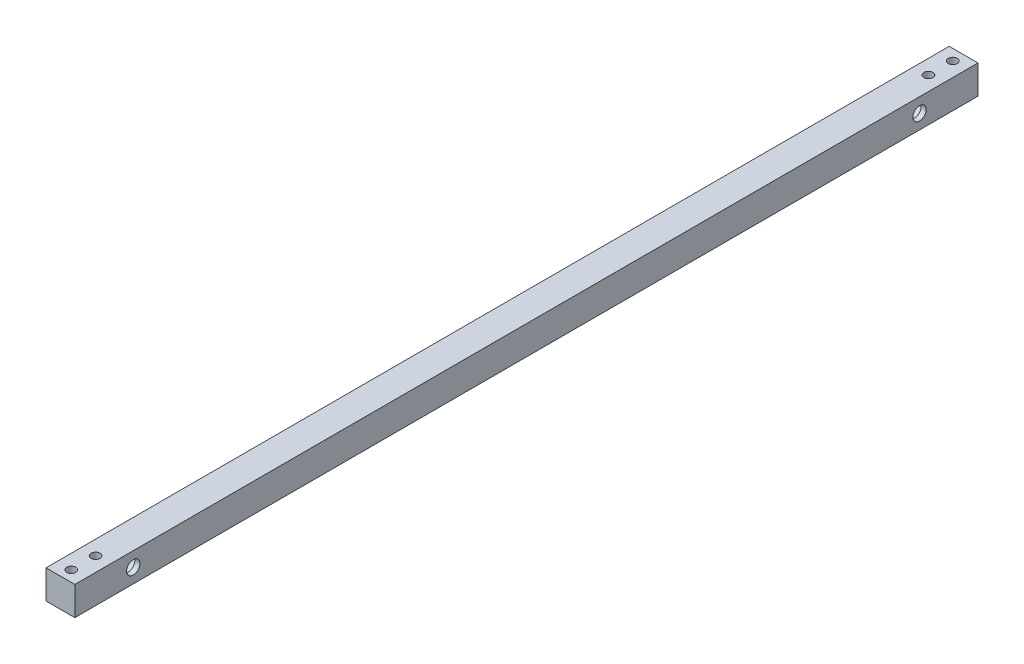
ISO-10303-21;
HEADER;
FILE_DESCRIPTION(('STEP AP214'),'2;1');
FILE_NAME('part.step','',(''),(''),'','','');
FILE_SCHEMA(('AUTOMOTIVE_DESIGN { 1 0 10303 214 1 1 1 1 }'));
ENDSEC;
DATA;
#1=APPLICATION_CONTEXT('core data for automotive mechanical design processes');
#2=APPLICATION_PROTOCOL_DEFINITION('international standard','automotive_design',2000,#1);
#3=PRODUCT_CONTEXT('',#1,'mechanical');
#4=PRODUCT('Part','Part','',(#3));
#5=PRODUCT_RELATED_PRODUCT_CATEGORY('part','',(#4));
#6=PRODUCT_DEFINITION_FORMATION('','',#4);
#7=PRODUCT_DEFINITION_CONTEXT('part definition',#1,'design');
#8=PRODUCT_DEFINITION('design','',#6,#7);
#9=PRODUCT_DEFINITION_SHAPE('','',#8);
#10=(LENGTH_UNIT() NAMED_UNIT(*) SI_UNIT(.MILLI.,.METRE.));
#11=(NAMED_UNIT(*) PLANE_ANGLE_UNIT() SI_UNIT($,.RADIAN.));
#12=(NAMED_UNIT(*) SI_UNIT($,.STERADIAN.) SOLID_ANGLE_UNIT());
#13=UNCERTAINTY_MEASURE_WITH_UNIT(LENGTH_MEASURE(1.E-05),#10,'distance_accuracy_value','');
#14=(GEOMETRIC_REPRESENTATION_CONTEXT(3) GLOBAL_UNCERTAINTY_ASSIGNED_CONTEXT((#13)) GLOBAL_UNIT_ASSIGNED_CONTEXT((#10,
#11,#12)) REPRESENTATION_CONTEXT('',''));
#15=CARTESIAN_POINT('',(0.,0.,0.));
#16=DIRECTION('',(0.,0.,1.));
#17=DIRECTION('',(1.,0.,0.));
#18=AXIS2_PLACEMENT_3D('',#15,#16,#17);
#19=CARTESIAN_POINT('',(0.,0.,497.84));
#20=DIRECTION('',(1.,0.,0.));
#21=DIRECTION('',(0.,1.,0.));
#22=AXIS2_PLACEMENT_3D('',#19,#20,#21);
#23=PLANE('',#22);
#24=CARTESIAN_POINT('',(0.,7.93749999999994,32.2199));
#25=DIRECTION('',(-1.,0.,0.));
#26=DIRECTION('',(0.,1.,0.));
#27=AXIS2_PLACEMENT_3D('',#24,#25,#26);
#28=CIRCLE('',#27,6.81989999999997);
#29=CARTESIAN_POINT('',(0.,14.7573999999999,32.2199));
#30=VERTEX_POINT('',#29);
#31=EDGE_CURVE('E159',#30,#30,#28,.T.);
#32=ORIENTED_EDGE('',*,*,#31,.F.);
#33=EDGE_LOOP('',(#32));
#34=FACE_BOUND('',#33,.T.);
#35=CARTESIAN_POINT('',(0.,7.9375,465.6201));
#36=DIRECTION('',(-1.,0.,0.));
#37=DIRECTION('',(0.,-1.,0.));
#38=AXIS2_PLACEMENT_3D('',#35,#36,#37);
#39=CIRCLE('',#38,6.81989999999997);
#40=CARTESIAN_POINT('',(0.,1.11760000000003,465.6201));
#41=VERTEX_POINT('',#40);
#42=EDGE_CURVE('E163',#41,#41,#39,.T.);
#43=ORIENTED_EDGE('',*,*,#42,.F.);
#44=EDGE_LOOP('',(#43));
#45=FACE_BOUND('',#44,.T.);
#46=DIRECTION('',(0.,-1.,0.));
#47=VECTOR('',#46,1.);
#48=CARTESIAN_POINT('',(0.,0.,0.));
#49=LINE('',#48,#47);
#50=CARTESIAN_POINT('',(0.,15.875,0.));
#51=VERTEX_POINT('',#50);
#52=CARTESIAN_POINT('',(0.,0.,0.));
#53=VERTEX_POINT('',#52);
#54=EDGE_CURVE('E100',#51,#53,#49,.T.);
#55=ORIENTED_EDGE('',*,*,#54,.T.);
#56=DIRECTION('',(0.,0.,-1.));
#57=VECTOR('',#56,1.);
#58=CARTESIAN_POINT('',(0.,0.,497.84));
#59=LINE('',#58,#57);
#60=CARTESIAN_POINT('',(0.,0.,497.84));
#61=VERTEX_POINT('',#60);
#62=EDGE_CURVE('E11',#61,#53,#59,.T.);
#63=ORIENTED_EDGE('',*,*,#62,.F.);
#64=DIRECTION('',(0.,-1.,0.));
#65=VECTOR('',#64,1.);
#66=CARTESIAN_POINT('',(0.,0.,497.84));
#67=LINE('',#66,#65);
#68=CARTESIAN_POINT('',(0.,15.875,497.84));
#69=VERTEX_POINT('',#68);
#70=EDGE_CURVE('E87',#69,#61,#67,.T.);
#71=ORIENTED_EDGE('',*,*,#70,.F.);
#72=DIRECTION('',(0.,0.,-1.));
#73=VECTOR('',#72,1.);
#74=CARTESIAN_POINT('',(0.,15.875,497.84));
#75=LINE('',#74,#73);
#76=EDGE_CURVE('E96',#69,#51,#75,.T.);
#77=ORIENTED_EDGE('',*,*,#76,.T.);
#78=EDGE_LOOP('',(#55,#63,#71,#77));
#79=FACE_BOUND('',#78,.T.);
#80=ADVANCED_FACE('F34',(#34,#45,#79),#23,.F.);
#81=CARTESIAN_POINT('',(0.,0.,497.84));
#82=DIRECTION('',(0.,1.,0.));
#83=DIRECTION('',(0.,0.,1.));
#84=AXIS2_PLACEMENT_3D('',#81,#82,#83);
#85=PLANE('',#84);
#86=CARTESIAN_POINT('',(7.93749999999993,1.99819154278469E-12,6.00000000000001));
#87=DIRECTION('',(0.,-1.,0.));
#88=DIRECTION('',(0.,0.,-1.));
#89=AXIS2_PLACEMENT_3D('',#86,#87,#88);
#90=CIRCLE('',#89,4.7625);
#91=CARTESIAN_POINT('',(7.93749999999993,1.99819154278469E-12,1.23750000000001));
#92=VERTEX_POINT('',#91);
#93=EDGE_CURVE('E203',#92,#92,#90,.T.);
#94=ORIENTED_EDGE('',*,*,#93,.F.);
#95=EDGE_LOOP('',(#94));
#96=FACE_BOUND('',#95,.T.);
#97=CARTESIAN_POINT('',(7.93749999999993,2.00116694049068E-12,19.4000000000001));
#98=DIRECTION('',(0.,-1.,0.));
#99=DIRECTION('',(0.,0.,-1.));
#100=AXIS2_PLACEMENT_3D('',#97,#98,#99);
#101=CIRCLE('',#100,4.7625);
#102=CARTESIAN_POINT('',(7.93749999999993,2.00116694049068E-12,14.6375000000001));
#103=VERTEX_POINT('',#102);
#104=EDGE_CURVE('E137',#103,#103,#101,.T.);
#105=ORIENTED_EDGE('',*,*,#104,.F.);
#106=EDGE_LOOP('',(#105));
#107=FACE_BOUND('',#106,.T.);
#108=CARTESIAN_POINT('',(7.9374999999996,2.3251389008605E-12,478.44));
#109=DIRECTION('',(0.,-1.,0.));
#110=DIRECTION('',(0.,0.,-1.));
#111=AXIS2_PLACEMENT_3D('',#108,#109,#110);
#112=CIRCLE('',#111,4.7625);
#113=CARTESIAN_POINT('',(7.9374999999996,2.3251389008605E-12,473.6775));
#114=VERTEX_POINT('',#113);
#115=EDGE_CURVE('E124',#114,#114,#112,.T.);
#116=ORIENTED_EDGE('',*,*,#115,.F.);
#117=EDGE_LOOP('',(#116));
#118=FACE_BOUND('',#117,.T.);
#119=CARTESIAN_POINT('',(7.9374999999996,2.3281142985665E-12,491.84));
#120=DIRECTION('',(0.,-1.,0.));
#121=DIRECTION('',(0.,0.,-1.));
#122=AXIS2_PLACEMENT_3D('',#119,#120,#121);
#123=CIRCLE('',#122,4.7625);
#124=CARTESIAN_POINT('',(7.9374999999996,2.3281142985665E-12,487.0775));
#125=VERTEX_POINT('',#124);
#126=EDGE_CURVE('E120',#125,#125,#123,.T.);
#127=ORIENTED_EDGE('',*,*,#126,.F.);
#128=EDGE_LOOP('',(#127));
#129=FACE_BOUND('',#128,.T.);
#130=DIRECTION('',(1.,0.,0.));
#131=VECTOR('',#130,1.);
#132=CARTESIAN_POINT('',(0.,0.,0.));
#133=LINE('',#132,#131);
#134=CARTESIAN_POINT('',(15.875,0.,0.));
#135=VERTEX_POINT('',#134);
#136=EDGE_CURVE('E91',#53,#135,#133,.T.);
#137=ORIENTED_EDGE('',*,*,#136,.T.);
#138=DIRECTION('',(0.,0.,-1.));
#139=VECTOR('',#138,1.);
#140=CARTESIAN_POINT('',(15.875,0.,497.84));
#141=LINE('',#140,#139);
#142=CARTESIAN_POINT('',(15.875,0.,497.84));
#143=VERTEX_POINT('',#142);
#144=EDGE_CURVE('E43',#143,#135,#141,.T.);
#145=ORIENTED_EDGE('',*,*,#144,.F.);
#146=DIRECTION('',(1.,0.,0.));
#147=VECTOR('',#146,1.);
#148=CARTESIAN_POINT('',(0.,0.,497.84));
#149=LINE('',#148,#147);
#150=EDGE_CURVE('E82',#61,#143,#149,.T.);
#151=ORIENTED_EDGE('',*,*,#150,.F.);
#152=ORIENTED_EDGE('',*,*,#62,.T.);
#153=EDGE_LOOP('',(#137,#145,#151,#152));
#154=FACE_BOUND('',#153,.T.);
#155=ADVANCED_FACE('F90',(#96,#107,#118,#129,#154),#85,.F.);
#156=CARTESIAN_POINT('',(15.875,0.,497.84));
#157=DIRECTION('',(-1.,0.,0.));
#158=DIRECTION('',(0.,-1.,0.));
#159=AXIS2_PLACEMENT_3D('',#156,#157,#158);
#160=PLANE('',#159);
#161=CARTESIAN_POINT('',(15.875,7.93749999999994,32.2199));
#162=DIRECTION('',(-1.,0.,0.));
#163=DIRECTION('',(0.,-1.,0.));
#164=AXIS2_PLACEMENT_3D('',#161,#162,#163);
#165=CIRCLE('',#164,3.68299999999999);
#166=CARTESIAN_POINT('',(15.875,4.25449999999995,32.2199));
#167=VERTEX_POINT('',#166);
#168=EDGE_CURVE('E109',#167,#167,#165,.T.);
#169=ORIENTED_EDGE('',*,*,#168,.T.);
#170=EDGE_LOOP('',(#169));
#171=FACE_BOUND('',#170,.T.);
#172=CARTESIAN_POINT('',(15.875,7.9375,465.6201));
#173=DIRECTION('',(-1.,0.,0.));
#174=DIRECTION('',(0.,-1.,0.));
#175=AXIS2_PLACEMENT_3D('',#172,#173,#174);
#176=CIRCLE('',#175,3.68299999999999);
#177=CARTESIAN_POINT('',(15.875,4.25450000000001,465.6201));
#178=VERTEX_POINT('',#177);
#179=EDGE_CURVE('E156',#178,#178,#176,.T.);
#180=ORIENTED_EDGE('',*,*,#179,.T.);
#181=EDGE_LOOP('',(#180));
#182=FACE_BOUND('',#181,.T.);
#183=DIRECTION('',(0.,1.,0.));
#184=VECTOR('',#183,1.);
#185=CARTESIAN_POINT('',(15.875,0.,0.));
#186=LINE('',#185,#184);
#187=CARTESIAN_POINT('',(15.875,15.875,0.));
#188=VERTEX_POINT('',#187);
#189=EDGE_CURVE('E69',#135,#188,#186,.T.);
#190=ORIENTED_EDGE('',*,*,#189,.T.);
#191=DIRECTION('',(0.,0.,-1.));
#192=VECTOR('',#191,1.);
#193=CARTESIAN_POINT('',(15.875,15.875,497.84));
#194=LINE('',#193,#192);
#195=CARTESIAN_POINT('',(15.875,15.875,497.84));
#196=VERTEX_POINT('',#195);
#197=EDGE_CURVE('E92',#196,#188,#194,.T.);
#198=ORIENTED_EDGE('',*,*,#197,.F.);
#199=DIRECTION('',(0.,1.,0.));
#200=VECTOR('',#199,1.);
#201=CARTESIAN_POINT('',(15.875,0.,497.84));
#202=LINE('',#201,#200);
#203=EDGE_CURVE('E85',#143,#196,#202,.T.);
#204=ORIENTED_EDGE('',*,*,#203,.F.);
#205=ORIENTED_EDGE('',*,*,#144,.T.);
#206=EDGE_LOOP('',(#190,#198,#204,#205));
#207=FACE_BOUND('',#206,.T.);
#208=ADVANCED_FACE('F94',(#171,#182,#207),#160,.F.);
#209=CARTESIAN_POINT('',(0.,15.875,497.84));
#210=DIRECTION('',(0.,-1.,0.));
#211=DIRECTION('',(0.,0.,-1.));
#212=AXIS2_PLACEMENT_3D('',#209,#210,#211);
#213=PLANE('',#212);
#214=CARTESIAN_POINT('',(7.93749999999993,15.875,6.00000000000001));
#215=DIRECTION('',(0.,-1.,0.));
#216=DIRECTION('',(0.,0.,-1.));
#217=AXIS2_PLACEMENT_3D('',#214,#215,#216);
#218=CIRCLE('',#217,2.4892);
#219=CARTESIAN_POINT('',(7.93749999999993,15.875,3.51080000000001));
#220=VERTEX_POINT('',#219);
#221=EDGE_CURVE('E37',#220,#220,#218,.T.);
#222=ORIENTED_EDGE('',*,*,#221,.T.);
#223=EDGE_LOOP('',(#222));
#224=FACE_BOUND('',#223,.T.);
#225=CARTESIAN_POINT('',(7.93749999999993,15.875,19.4000000000001));
#226=DIRECTION('',(0.,-1.,0.));
#227=DIRECTION('',(0.,0.,-1.));
#228=AXIS2_PLACEMENT_3D('',#225,#226,#227);
#229=CIRCLE('',#228,2.4892);
#230=CARTESIAN_POINT('',(7.93749999999993,15.875,16.9108000000001));
#231=VERTEX_POINT('',#230);
#232=EDGE_CURVE('E122',#231,#231,#229,.T.);
#233=ORIENTED_EDGE('',*,*,#232,.T.);
#234=EDGE_LOOP('',(#233));
#235=FACE_BOUND('',#234,.T.);
#236=CARTESIAN_POINT('',(7.9374999999996,15.875,478.44));
#237=DIRECTION('',(0.,-1.,0.));
#238=DIRECTION('',(0.,0.,-1.));
#239=AXIS2_PLACEMENT_3D('',#236,#237,#238);
#240=CIRCLE('',#239,2.4892);
#241=CARTESIAN_POINT('',(7.9374999999996,15.875,475.9508));
#242=VERTEX_POINT('',#241);
#243=EDGE_CURVE('E118',#242,#242,#240,.T.);
#244=ORIENTED_EDGE('',*,*,#243,.T.);
#245=EDGE_LOOP('',(#244));
#246=FACE_BOUND('',#245,.T.);
#247=CARTESIAN_POINT('',(7.9374999999996,15.875,491.84));
#248=DIRECTION('',(0.,-1.,0.));
#249=DIRECTION('',(0.,0.,-1.));
#250=AXIS2_PLACEMENT_3D('',#247,#248,#249);
#251=CIRCLE('',#250,2.4892);
#252=CARTESIAN_POINT('',(7.9374999999996,15.875,489.3508));
#253=VERTEX_POINT('',#252);
#254=EDGE_CURVE('E114',#253,#253,#251,.T.);
#255=ORIENTED_EDGE('',*,*,#254,.T.);
#256=EDGE_LOOP('',(#255));
#257=FACE_BOUND('',#256,.T.);
#258=DIRECTION('',(-1.,0.,0.));
#259=VECTOR('',#258,1.);
#260=CARTESIAN_POINT('',(0.,15.875,0.));
#261=LINE('',#260,#259);
#262=EDGE_CURVE('E75',#188,#51,#261,.T.);
#263=ORIENTED_EDGE('',*,*,#262,.T.);
#264=ORIENTED_EDGE('',*,*,#76,.F.);
#265=DIRECTION('',(-1.,0.,0.));
#266=VECTOR('',#265,1.);
#267=CARTESIAN_POINT('',(0.,15.875,497.84));
#268=LINE('',#267,#266);
#269=EDGE_CURVE('E52',#196,#69,#268,.T.);
#270=ORIENTED_EDGE('',*,*,#269,.F.);
#271=ORIENTED_EDGE('',*,*,#197,.T.);
#272=EDGE_LOOP('',(#263,#264,#270,#271));
#273=FACE_BOUND('',#272,.T.);
#274=ADVANCED_FACE('F188',(#224,#235,#246,#257,#273),#213,.F.);
#275=CARTESIAN_POINT('',(0.,0.,497.84));
#276=DIRECTION('',(0.,0.,-1.));
#277=DIRECTION('',(-1.,0.,0.));
#278=AXIS2_PLACEMENT_3D('',#275,#276,#277);
#279=PLANE('',#278);
#280=ORIENTED_EDGE('',*,*,#70,.T.);
#281=ORIENTED_EDGE('',*,*,#150,.T.);
#282=ORIENTED_EDGE('',*,*,#203,.T.);
#283=ORIENTED_EDGE('',*,*,#269,.T.);
#284=EDGE_LOOP('',(#280,#281,#282,#283));
#285=FACE_BOUND('',#284,.T.);
#286=ADVANCED_FACE('F83',(#285),#279,.F.);
#287=CARTESIAN_POINT('',(0.,0.,0.));
#288=DIRECTION('',(0.,0.,-1.));
#289=DIRECTION('',(-1.,0.,0.));
#290=AXIS2_PLACEMENT_3D('',#287,#288,#289);
#291=PLANE('',#290);
#292=ORIENTED_EDGE('',*,*,#54,.F.);
#293=ORIENTED_EDGE('',*,*,#262,.F.);
#294=ORIENTED_EDGE('',*,*,#189,.F.);
#295=ORIENTED_EDGE('',*,*,#136,.F.);
#296=EDGE_LOOP('',(#292,#293,#294,#295));
#297=FACE_BOUND('',#296,.T.);
#298=ADVANCED_FACE('F178',(#297),#291,.T.);
#299=CARTESIAN_POINT('',(13.08608,7.9375,465.6201));
#300=DIRECTION('',(-1.,0.,0.));
#301=DIRECTION('',(0.,-1.,0.));
#302=AXIS2_PLACEMENT_3D('',#299,#300,#301);
#303=CYLINDRICAL_SURFACE('',#302,6.81989999999997);
#304=CARTESIAN_POINT('',(13.08608,7.9375,465.6201));
#305=DIRECTION('',(-1.,0.,0.));
#306=DIRECTION('',(0.,-1.,0.));
#307=AXIS2_PLACEMENT_3D('',#304,#305,#306);
#308=CIRCLE('',#307,6.81989999999997);
#309=CARTESIAN_POINT('',(13.08608,1.11760000000003,465.6201));
#310=VERTEX_POINT('',#309);
#311=EDGE_CURVE('E103',#310,#310,#308,.T.);
#312=ORIENTED_EDGE('',*,*,#311,.F.);
#313=EDGE_LOOP('',(#312));
#314=FACE_BOUND('',#313,.T.);
#315=ORIENTED_EDGE('',*,*,#42,.T.);
#316=EDGE_LOOP('',(#315));
#317=FACE_BOUND('',#316,.T.);
#318=ADVANCED_FACE('F171',(#314,#317),#303,.F.);
#319=CARTESIAN_POINT('',(13.08608,7.9375,465.6201));
#320=DIRECTION('',(-1.,0.,0.));
#321=DIRECTION('',(0.,-1.,0.));
#322=AXIS2_PLACEMENT_3D('',#319,#320,#321);
#323=PLANE('',#322);
#324=CARTESIAN_POINT('',(13.08608,7.9375,465.6201));
#325=DIRECTION('',(-1.,0.,0.));
#326=DIRECTION('',(0.,0.,1.));
#327=AXIS2_PLACEMENT_3D('',#324,#325,#326);
#328=CIRCLE('',#327,3.68299999999999);
#329=CARTESIAN_POINT('',(13.08608,7.9375,469.3031));
#330=VERTEX_POINT('',#329);
#331=EDGE_CURVE('E112',#330,#330,#328,.T.);
#332=ORIENTED_EDGE('',*,*,#331,.F.);
#333=EDGE_LOOP('',(#332));
#334=FACE_BOUND('',#333,.T.);
#335=ORIENTED_EDGE('',*,*,#311,.T.);
#336=EDGE_LOOP('',(#335));
#337=FACE_BOUND('',#336,.T.);
#338=ADVANCED_FACE('F185',(#334,#337),#323,.T.);
#339=CARTESIAN_POINT('',(13.08608,7.93749999999994,32.2199));
#340=DIRECTION('',(-1.,0.,0.));
#341=DIRECTION('',(0.,-1.,0.));
#342=AXIS2_PLACEMENT_3D('',#339,#340,#341);
#343=CYLINDRICAL_SURFACE('',#342,6.81989999999997);
#344=CARTESIAN_POINT('',(13.08608,7.93749999999994,32.2199));
#345=DIRECTION('',(-1.,0.,0.));
#346=DIRECTION('',(0.,1.,0.));
#347=AXIS2_PLACEMENT_3D('',#344,#345,#346);
#348=CIRCLE('',#347,6.81989999999997);
#349=CARTESIAN_POINT('',(13.08608,14.7573999999999,32.2199));
#350=VERTEX_POINT('',#349);
#351=EDGE_CURVE('E160',#350,#350,#348,.T.);
#352=ORIENTED_EDGE('',*,*,#351,.F.);
#353=EDGE_LOOP('',(#352));
#354=FACE_BOUND('',#353,.T.);
#355=ORIENTED_EDGE('',*,*,#31,.T.);
#356=EDGE_LOOP('',(#355));
#357=FACE_BOUND('',#356,.T.);
#358=ADVANCED_FACE('F244',(#354,#357),#343,.F.);
#359=CARTESIAN_POINT('',(13.08608,7.93749999999994,32.2199));
#360=DIRECTION('',(1.,0.,0.));
#361=DIRECTION('',(0.,1.,0.));
#362=AXIS2_PLACEMENT_3D('',#359,#360,#361);
#363=PLANE('',#362);
#364=CARTESIAN_POINT('',(13.08608,7.93749999999994,32.2199));
#365=DIRECTION('',(-1.,0.,0.));
#366=DIRECTION('',(0.,0.,1.));
#367=AXIS2_PLACEMENT_3D('',#364,#365,#366);
#368=CIRCLE('',#367,3.68299999999999);
#369=CARTESIAN_POINT('',(13.08608,7.93749999999994,35.9029));
#370=VERTEX_POINT('',#369);
#371=EDGE_CURVE('E113',#370,#370,#368,.T.);
#372=ORIENTED_EDGE('',*,*,#371,.F.);
#373=EDGE_LOOP('',(#372));
#374=FACE_BOUND('',#373,.T.);
#375=ORIENTED_EDGE('',*,*,#351,.T.);
#376=EDGE_LOOP('',(#375));
#377=FACE_BOUND('',#376,.T.);
#378=ADVANCED_FACE('F240',(#374,#377),#363,.F.);
#379=CARTESIAN_POINT('',(13.08608,7.9375,465.6201));
#380=DIRECTION('',(-1.,0.,0.));
#381=DIRECTION('',(0.,0.,1.));
#382=AXIS2_PLACEMENT_3D('',#379,#380,#381);
#383=CYLINDRICAL_SURFACE('',#382,3.68299999999999);
#384=ORIENTED_EDGE('',*,*,#331,.T.);
#385=EDGE_LOOP('',(#384));
#386=FACE_BOUND('',#385,.T.);
#387=ORIENTED_EDGE('',*,*,#179,.F.);
#388=EDGE_LOOP('',(#387));
#389=FACE_BOUND('',#388,.T.);
#390=ADVANCED_FACE('F236',(#386,#389),#383,.F.);
#391=CARTESIAN_POINT('',(13.08608,7.93749999999994,32.2199));
#392=DIRECTION('',(-1.,0.,0.));
#393=DIRECTION('',(0.,0.,1.));
#394=AXIS2_PLACEMENT_3D('',#391,#392,#393);
#395=CYLINDRICAL_SURFACE('',#394,3.68299999999999);
#396=ORIENTED_EDGE('',*,*,#371,.T.);
#397=EDGE_LOOP('',(#396));
#398=FACE_BOUND('',#397,.T.);
#399=ORIENTED_EDGE('',*,*,#168,.F.);
#400=EDGE_LOOP('',(#399));
#401=FACE_BOUND('',#400,.T.);
#402=ADVANCED_FACE('F232',(#398,#401),#395,.F.);
#403=CARTESIAN_POINT('',(7.9374999999996,2.3281142985665E-12,491.84));
#404=DIRECTION('',(0.,-1.,0.));
#405=DIRECTION('',(0.,0.,-1.));
#406=AXIS2_PLACEMENT_3D('',#403,#404,#405);
#407=CYLINDRICAL_SURFACE('',#406,2.4892);
#408=CARTESIAN_POINT('',(7.9374999999996,4.82600000000233,491.84));
#409=DIRECTION('',(0.,-1.,0.));
#410=DIRECTION('',(0.,0.,-1.));
#411=AXIS2_PLACEMENT_3D('',#408,#409,#410);
#412=CIRCLE('',#411,2.4892);
#413=CARTESIAN_POINT('',(7.9374999999996,4.82600000000233,489.3508));
#414=VERTEX_POINT('',#413);
#415=EDGE_CURVE('E117',#414,#414,#412,.T.);
#416=ORIENTED_EDGE('',*,*,#415,.T.);
#417=EDGE_LOOP('',(#416));
#418=FACE_BOUND('',#417,.T.);
#419=ORIENTED_EDGE('',*,*,#254,.F.);
#420=EDGE_LOOP('',(#419));
#421=FACE_BOUND('',#420,.T.);
#422=ADVANCED_FACE('F224',(#418,#421),#407,.F.);
#423=CARTESIAN_POINT('',(10.4266999999996,4.82600000000233,491.84));
#424=DIRECTION('',(0.,1.,0.));
#425=DIRECTION('',(0.,0.,1.));
#426=AXIS2_PLACEMENT_3D('',#423,#424,#425);
#427=PLANE('',#426);
#428=ORIENTED_EDGE('',*,*,#415,.F.);
#429=EDGE_LOOP('',(#428));
#430=FACE_BOUND('',#429,.T.);
#431=CARTESIAN_POINT('',(7.9374999999996,4.82600000000233,491.84));
#432=DIRECTION('',(0.,-1.,0.));
#433=DIRECTION('',(0.,0.,-1.));
#434=AXIS2_PLACEMENT_3D('',#431,#432,#433);
#435=CIRCLE('',#434,4.7625);
#436=CARTESIAN_POINT('',(7.9374999999996,4.82600000000233,487.0775));
#437=VERTEX_POINT('',#436);
#438=EDGE_CURVE('E147',#437,#437,#435,.T.);
#439=ORIENTED_EDGE('',*,*,#438,.T.);
#440=EDGE_LOOP('',(#439));
#441=FACE_BOUND('',#440,.T.);
#442=ADVANCED_FACE('F214',(#430,#441),#427,.F.);
#443=CARTESIAN_POINT('',(7.9374999999996,2.3281142985665E-12,491.84));
#444=DIRECTION('',(0.,-1.,0.));
#445=DIRECTION('',(0.,0.,-1.));
#446=AXIS2_PLACEMENT_3D('',#443,#444,#445);
#447=CYLINDRICAL_SURFACE('',#446,4.7625);
#448=ORIENTED_EDGE('',*,*,#438,.F.);
#449=EDGE_LOOP('',(#448));
#450=FACE_BOUND('',#449,.T.);
#451=ORIENTED_EDGE('',*,*,#126,.T.);
#452=EDGE_LOOP('',(#451));
#453=FACE_BOUND('',#452,.T.);
#454=ADVANCED_FACE('F211',(#450,#453),#447,.F.);
#455=CARTESIAN_POINT('',(7.9374999999996,2.3251389008605E-12,478.44));
#456=DIRECTION('',(0.,-1.,0.));
#457=DIRECTION('',(0.,0.,-1.));
#458=AXIS2_PLACEMENT_3D('',#455,#456,#457);
#459=CYLINDRICAL_SURFACE('',#458,2.4892);
#460=CARTESIAN_POINT('',(7.9374999999996,4.82600000000233,478.44));
#461=DIRECTION('',(0.,-1.,0.));
#462=DIRECTION('',(0.,0.,-1.));
#463=AXIS2_PLACEMENT_3D('',#460,#461,#462);
#464=CIRCLE('',#463,2.4892);
#465=CARTESIAN_POINT('',(7.9374999999996,4.82600000000233,475.9508));
#466=VERTEX_POINT('',#465);
#467=EDGE_CURVE('E121',#466,#466,#464,.T.);
#468=ORIENTED_EDGE('',*,*,#467,.T.);
#469=EDGE_LOOP('',(#468));
#470=FACE_BOUND('',#469,.T.);
#471=ORIENTED_EDGE('',*,*,#243,.F.);
#472=EDGE_LOOP('',(#471));
#473=FACE_BOUND('',#472,.T.);
#474=ADVANCED_FACE('F213',(#470,#473),#459,.F.);
#475=CARTESIAN_POINT('',(10.4266999999996,4.82600000000232,478.44));
#476=DIRECTION('',(0.,1.,0.));
#477=DIRECTION('',(0.,0.,1.));
#478=AXIS2_PLACEMENT_3D('',#475,#476,#477);
#479=PLANE('',#478);
#480=ORIENTED_EDGE('',*,*,#467,.F.);
#481=EDGE_LOOP('',(#480));
#482=FACE_BOUND('',#481,.T.);
#483=CARTESIAN_POINT('',(7.9374999999996,4.82600000000232,478.44));
#484=DIRECTION('',(0.,-1.,0.));
#485=DIRECTION('',(0.,0.,-1.));
#486=AXIS2_PLACEMENT_3D('',#483,#484,#485);
#487=CIRCLE('',#486,4.7625);
#488=CARTESIAN_POINT('',(7.9374999999996,4.82600000000232,473.6775));
#489=VERTEX_POINT('',#488);
#490=EDGE_CURVE('E129',#489,#489,#487,.T.);
#491=ORIENTED_EDGE('',*,*,#490,.T.);
#492=EDGE_LOOP('',(#491));
#493=FACE_BOUND('',#492,.T.);
#494=ADVANCED_FACE('F221',(#482,#493),#479,.F.);
#495=CARTESIAN_POINT('',(7.9374999999996,2.3251389008605E-12,478.44));
#496=DIRECTION('',(0.,-1.,0.));
#497=DIRECTION('',(0.,0.,-1.));
#498=AXIS2_PLACEMENT_3D('',#495,#496,#497);
#499=CYLINDRICAL_SURFACE('',#498,4.7625);
#500=ORIENTED_EDGE('',*,*,#490,.F.);
#501=EDGE_LOOP('',(#500));
#502=FACE_BOUND('',#501,.T.);
#503=ORIENTED_EDGE('',*,*,#115,.T.);
#504=EDGE_LOOP('',(#503));
#505=FACE_BOUND('',#504,.T.);
#506=ADVANCED_FACE('F305',(#502,#505),#499,.F.);
#507=CARTESIAN_POINT('',(7.93749999999993,2.00116694049068E-12,19.4000000000001));
#508=DIRECTION('',(0.,-1.,0.));
#509=DIRECTION('',(0.,0.,-1.));
#510=AXIS2_PLACEMENT_3D('',#507,#508,#509);
#511=CYLINDRICAL_SURFACE('',#510,2.4892);
#512=CARTESIAN_POINT('',(7.93749999999993,4.826000000002,19.4000000000001));
#513=DIRECTION('',(0.,-1.,0.));
#514=DIRECTION('',(0.,0.,-1.));
#515=AXIS2_PLACEMENT_3D('',#512,#513,#514);
#516=CIRCLE('',#515,2.4892);
#517=CARTESIAN_POINT('',(7.93749999999993,4.826000000002,16.9108000000001));
#518=VERTEX_POINT('',#517);
#519=EDGE_CURVE('E125',#518,#518,#516,.T.);
#520=ORIENTED_EDGE('',*,*,#519,.T.);
#521=EDGE_LOOP('',(#520));
#522=FACE_BOUND('',#521,.T.);
#523=ORIENTED_EDGE('',*,*,#232,.F.);
#524=EDGE_LOOP('',(#523));
#525=FACE_BOUND('',#524,.T.);
#526=ADVANCED_FACE('F313',(#522,#525),#511,.F.);
#527=CARTESIAN_POINT('',(10.4266999999999,4.826000000002,19.4000000000001));
#528=DIRECTION('',(0.,1.,0.));
#529=DIRECTION('',(0.,0.,1.));
#530=AXIS2_PLACEMENT_3D('',#527,#528,#529);
#531=PLANE('',#530);
#532=ORIENTED_EDGE('',*,*,#519,.F.);
#533=EDGE_LOOP('',(#532));
#534=FACE_BOUND('',#533,.T.);
#535=CARTESIAN_POINT('',(7.93749999999993,4.826000000002,19.4000000000001));
#536=DIRECTION('',(0.,-1.,0.));
#537=DIRECTION('',(0.,0.,-1.));
#538=AXIS2_PLACEMENT_3D('',#535,#536,#537);
#539=CIRCLE('',#538,4.7625);
#540=CARTESIAN_POINT('',(7.93749999999993,4.826000000002,14.6375000000001));
#541=VERTEX_POINT('',#540);
#542=EDGE_CURVE('E132',#541,#541,#539,.T.);
#543=ORIENTED_EDGE('',*,*,#542,.T.);
#544=EDGE_LOOP('',(#543));
#545=FACE_BOUND('',#544,.T.);
#546=ADVANCED_FACE('F337',(#534,#545),#531,.F.);
#547=CARTESIAN_POINT('',(7.93749999999993,2.00116694049068E-12,19.4000000000001));
#548=DIRECTION('',(0.,-1.,0.));
#549=DIRECTION('',(0.,0.,-1.));
#550=AXIS2_PLACEMENT_3D('',#547,#548,#549);
#551=CYLINDRICAL_SURFACE('',#550,4.7625);
#552=ORIENTED_EDGE('',*,*,#542,.F.);
#553=EDGE_LOOP('',(#552));
#554=FACE_BOUND('',#553,.T.);
#555=ORIENTED_EDGE('',*,*,#104,.T.);
#556=EDGE_LOOP('',(#555));
#557=FACE_BOUND('',#556,.T.);
#558=ADVANCED_FACE('F346',(#554,#557),#551,.F.);
#559=CARTESIAN_POINT('',(7.93749999999993,1.99819154278469E-12,6.00000000000001));
#560=DIRECTION('',(0.,-1.,0.));
#561=DIRECTION('',(0.,0.,-1.));
#562=AXIS2_PLACEMENT_3D('',#559,#560,#561);
#563=CYLINDRICAL_SURFACE('',#562,2.4892);
#564=CARTESIAN_POINT('',(7.93749999999993,4.826000000002,6.00000000000001));
#565=DIRECTION('',(0.,-1.,0.));
#566=DIRECTION('',(0.,0.,-1.));
#567=AXIS2_PLACEMENT_3D('',#564,#565,#566);
#568=CIRCLE('',#567,2.4892);
#569=CARTESIAN_POINT('',(7.93749999999993,4.826000000002,3.51080000000001));
#570=VERTEX_POINT('',#569);
#571=EDGE_CURVE('E395',#570,#570,#568,.T.);
#572=ORIENTED_EDGE('',*,*,#571,.T.);
#573=EDGE_LOOP('',(#572));
#574=FACE_BOUND('',#573,.T.);
#575=ORIENTED_EDGE('',*,*,#221,.F.);
#576=EDGE_LOOP('',(#575));
#577=FACE_BOUND('',#576,.T.);
#578=ADVANCED_FACE('F356',(#574,#577),#563,.F.);
#579=CARTESIAN_POINT('',(10.4266999999999,4.826000000002,6.00000000000001));
#580=DIRECTION('',(0.,1.,0.));
#581=DIRECTION('',(0.,0.,1.));
#582=AXIS2_PLACEMENT_3D('',#579,#580,#581);
#583=PLANE('',#582);
#584=ORIENTED_EDGE('',*,*,#571,.F.);
#585=EDGE_LOOP('',(#584));
#586=FACE_BOUND('',#585,.T.);
#587=CARTESIAN_POINT('',(7.93749999999993,4.826000000002,6.00000000000001));
#588=DIRECTION('',(0.,-1.,0.));
#589=DIRECTION('',(0.,0.,-1.));
#590=AXIS2_PLACEMENT_3D('',#587,#588,#589);
#591=CIRCLE('',#590,4.7625);
#592=CARTESIAN_POINT('',(7.93749999999993,4.826000000002,1.23750000000001));
#593=VERTEX_POINT('',#592);
#594=EDGE_CURVE('E393',#593,#593,#591,.T.);
#595=ORIENTED_EDGE('',*,*,#594,.T.);
#596=EDGE_LOOP('',(#595));
#597=FACE_BOUND('',#596,.T.);
#598=ADVANCED_FACE('F366',(#586,#597),#583,.F.);
#599=CARTESIAN_POINT('',(7.93749999999993,1.99819154278469E-12,6.00000000000001));
#600=DIRECTION('',(0.,-1.,0.));
#601=DIRECTION('',(0.,0.,-1.));
#602=AXIS2_PLACEMENT_3D('',#599,#600,#601);
#603=CYLINDRICAL_SURFACE('',#602,4.7625);
#604=ORIENTED_EDGE('',*,*,#594,.F.);
#605=EDGE_LOOP('',(#604));
#606=FACE_BOUND('',#605,.T.);
#607=ORIENTED_EDGE('',*,*,#93,.T.);
#608=EDGE_LOOP('',(#607));
#609=FACE_BOUND('',#608,.T.);
#610=ADVANCED_FACE('F376',(#606,#609),#603,.F.);
#611=CLOSED_SHELL('',(#80,#155,#208,#274,#286,#298,#318,#338,#358,#378,#390,#402,#422,#442,#454,
#474,#494,#506,#526,#546,#558,#578,#598,#610));
#612=MANIFOLD_SOLID_BREP('B2',#611);
#613=ADVANCED_BREP_SHAPE_REPRESENTATION('',(#18,#612),#14);
#614=SHAPE_DEFINITION_REPRESENTATION(#9,#613);
ENDSEC;
END-ISO-10303-21;
